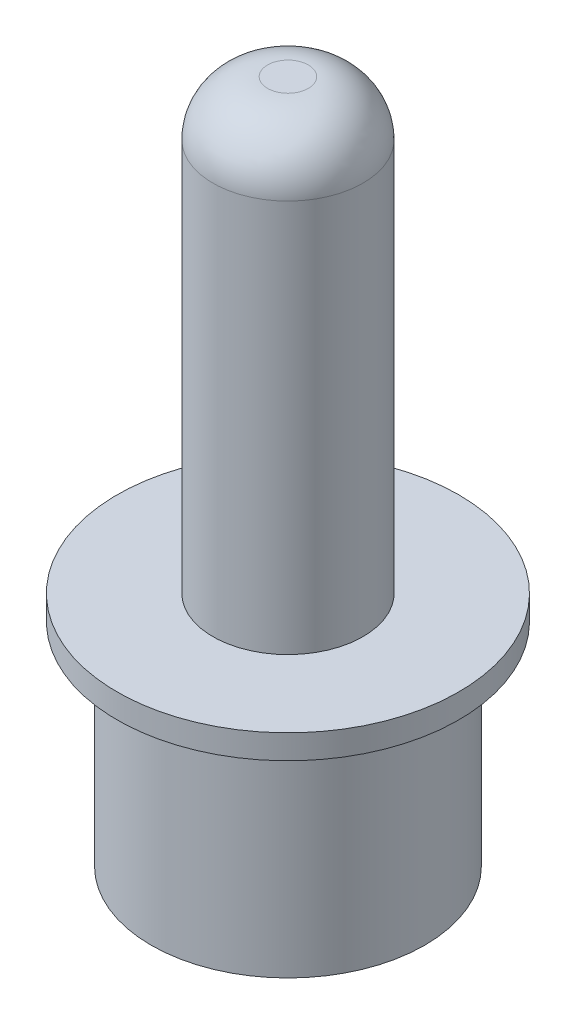
ISO-10303-21;
HEADER;
FILE_DESCRIPTION(('STEP AP214'),'2;1');
FILE_NAME('part.step','',(''),(''),'','','');
FILE_SCHEMA(('AUTOMOTIVE_DESIGN { 1 0 10303 214 1 1 1 1 }'));
ENDSEC;
DATA;
#1=APPLICATION_CONTEXT('core data for automotive mechanical design processes');
#2=APPLICATION_PROTOCOL_DEFINITION('international standard','automotive_design',2000,#1);
#3=PRODUCT_CONTEXT('',#1,'mechanical');
#4=PRODUCT('Part','Part','',(#3));
#5=PRODUCT_RELATED_PRODUCT_CATEGORY('part','',(#4));
#6=PRODUCT_DEFINITION_FORMATION('','',#4);
#7=PRODUCT_DEFINITION_CONTEXT('part definition',#1,'design');
#8=PRODUCT_DEFINITION('design','',#6,#7);
#9=PRODUCT_DEFINITION_SHAPE('','',#8);
#10=(LENGTH_UNIT() NAMED_UNIT(*) SI_UNIT(.MILLI.,.METRE.));
#11=(NAMED_UNIT(*) PLANE_ANGLE_UNIT() SI_UNIT($,.RADIAN.));
#12=(NAMED_UNIT(*) SI_UNIT($,.STERADIAN.) SOLID_ANGLE_UNIT());
#13=UNCERTAINTY_MEASURE_WITH_UNIT(LENGTH_MEASURE(1.E-05),#10,'distance_accuracy_value','');
#14=(GEOMETRIC_REPRESENTATION_CONTEXT(3) GLOBAL_UNCERTAINTY_ASSIGNED_CONTEXT((#13)) GLOBAL_UNIT_ASSIGNED_CONTEXT((#10,
#11,#12)) REPRESENTATION_CONTEXT('',''));
#15=CARTESIAN_POINT('',(0.,0.,0.));
#16=DIRECTION('',(0.,0.,1.));
#17=DIRECTION('',(1.,0.,0.));
#18=AXIS2_PLACEMENT_3D('',#15,#16,#17);
#19=CARTESIAN_POINT('',(0.,0.,0.));
#20=DIRECTION('',(0.,1.,0.));
#21=DIRECTION('',(0.,0.,1.));
#22=AXIS2_PLACEMENT_3D('',#19,#20,#21);
#23=PLANE('',#22);
#24=CARTESIAN_POINT('',(0.,0.,0.));
#25=DIRECTION('',(0.,-1.,0.));
#26=DIRECTION('',(0.,0.,-1.));
#27=AXIS2_PLACEMENT_3D('',#24,#25,#26);
#28=CIRCLE('',#27,1.5);
#29=CARTESIAN_POINT('',(0.,0.,-1.5));
#30=VERTEX_POINT('',#29);
#31=EDGE_CURVE('E63',#30,#30,#28,.T.);
#32=ORIENTED_EDGE('',*,*,#31,.F.);
#33=EDGE_LOOP('',(#32));
#34=FACE_BOUND('',#33,.T.);
#35=CARTESIAN_POINT('',(0.,0.,0.));
#36=DIRECTION('',(0.,-1.,0.));
#37=DIRECTION('',(0.,0.,-1.));
#38=AXIS2_PLACEMENT_3D('',#35,#36,#37);
#39=CIRCLE('',#38,5.);
#40=CARTESIAN_POINT('',(0.,0.,-5.));
#41=VERTEX_POINT('',#40);
#42=EDGE_CURVE('E44',#41,#41,#39,.T.);
#43=ORIENTED_EDGE('',*,*,#42,.T.);
#44=EDGE_LOOP('',(#43));
#45=FACE_BOUND('',#44,.T.);
#46=ADVANCED_FACE('F33',(#34,#45),#23,.F.);
#47=CARTESIAN_POINT('',(0.,0.,0.));
#48=DIRECTION('',(0.,-1.,0.));
#49=DIRECTION('',(0.,0.,-1.));
#50=AXIS2_PLACEMENT_3D('',#47,#48,#49);
#51=CYLINDRICAL_SURFACE('',#50,5.);
#52=ORIENTED_EDGE('',*,*,#42,.F.);
#53=EDGE_LOOP('',(#52));
#54=FACE_BOUND('',#53,.T.);
#55=CARTESIAN_POINT('',(0.,7.34311741162873,0.));
#56=DIRECTION('',(0.,-1.,0.));
#57=DIRECTION('',(0.,0.,-1.));
#58=AXIS2_PLACEMENT_3D('',#55,#56,#57);
#59=CIRCLE('',#58,5.);
#60=CARTESIAN_POINT('',(0.,7.34311741162873,-5.));
#61=VERTEX_POINT('',#60);
#62=EDGE_CURVE('E48',#61,#61,#59,.T.);
#63=ORIENTED_EDGE('',*,*,#62,.T.);
#64=EDGE_LOOP('',(#63));
#65=FACE_BOUND('',#64,.T.);
#66=ADVANCED_FACE('F79',(#54,#65),#51,.T.);
#67=CARTESIAN_POINT('',(0.,7.75587059294787,0.));
#68=DIRECTION('',(0.,1.,0.));
#69=DIRECTION('',(0.,0.,1.));
#70=AXIS2_PLACEMENT_3D('',#67,#68,#69);
#71=CONICAL_SURFACE('',#70,6.24411285293071,1.25045787747329);
#72=ORIENTED_EDGE('',*,*,#62,.F.);
#73=EDGE_LOOP('',(#72));
#74=FACE_BOUND('',#73,.T.);
#75=CARTESIAN_POINT('',(0.,7.75587059294787,0.));
#76=DIRECTION('',(0.,-1.,0.));
#77=DIRECTION('',(0.,0.,-1.));
#78=AXIS2_PLACEMENT_3D('',#75,#76,#77);
#79=CIRCLE('',#78,6.24411285293071);
#80=CARTESIAN_POINT('',(0.,7.75587059294787,-6.24411285293071));
#81=VERTEX_POINT('',#80);
#82=EDGE_CURVE('E53',#81,#81,#79,.T.);
#83=ORIENTED_EDGE('',*,*,#82,.T.);
#84=EDGE_LOOP('',(#83));
#85=FACE_BOUND('',#84,.T.);
#86=ADVANCED_FACE('F84',(#74,#85),#71,.T.);
#87=CARTESIAN_POINT('',(0.,0.,0.));
#88=DIRECTION('',(0.,-1.,0.));
#89=DIRECTION('',(0.,0.,-1.));
#90=AXIS2_PLACEMENT_3D('',#87,#88,#89);
#91=CYLINDRICAL_SURFACE('',#90,6.24411285293071);
#92=ORIENTED_EDGE('',*,*,#82,.F.);
#93=EDGE_LOOP('',(#92));
#94=FACE_BOUND('',#93,.T.);
#95=CARTESIAN_POINT('',(0.,8.64209144852606,0.));
#96=DIRECTION('',(0.,-1.,0.));
#97=DIRECTION('',(0.,0.,-1.));
#98=AXIS2_PLACEMENT_3D('',#95,#96,#97);
#99=CIRCLE('',#98,6.24411285293071);
#100=CARTESIAN_POINT('',(0.,8.64209144852606,-6.24411285293071));
#101=VERTEX_POINT('',#100);
#102=EDGE_CURVE('E56',#101,#101,#99,.T.);
#103=ORIENTED_EDGE('',*,*,#102,.T.);
#104=EDGE_LOOP('',(#103));
#105=FACE_BOUND('',#104,.T.);
#106=ADVANCED_FACE('F90',(#94,#105),#91,.T.);
#107=CARTESIAN_POINT('',(-6.24411285293071,8.64209144852606,0.));
#108=DIRECTION('',(0.,-1.,0.));
#109=DIRECTION('',(0.,0.,-1.));
#110=AXIS2_PLACEMENT_3D('',#107,#108,#109);
#111=PLANE('',#110);
#112=ORIENTED_EDGE('',*,*,#102,.F.);
#113=EDGE_LOOP('',(#112));
#114=FACE_BOUND('',#113,.T.);
#115=CARTESIAN_POINT('',(0.,8.64209144852606,0.));
#116=DIRECTION('',(0.,-1.,0.));
#117=DIRECTION('',(0.,0.,-1.));
#118=AXIS2_PLACEMENT_3D('',#115,#116,#117);
#119=CIRCLE('',#118,2.74411285293071);
#120=CARTESIAN_POINT('',(0.,8.64209144852606,-2.74411285293071));
#121=VERTEX_POINT('',#120);
#122=EDGE_CURVE('E59',#121,#121,#119,.T.);
#123=ORIENTED_EDGE('',*,*,#122,.T.);
#124=EDGE_LOOP('',(#123));
#125=FACE_BOUND('',#124,.T.);
#126=ADVANCED_FACE('F96',(#114,#125),#111,.F.);
#127=CARTESIAN_POINT('',(0.,0.,0.));
#128=DIRECTION('',(0.,-1.,0.));
#129=DIRECTION('',(0.,0.,-1.));
#130=AXIS2_PLACEMENT_3D('',#127,#128,#129);
#131=CYLINDRICAL_SURFACE('',#130,2.74411285293071);
#132=CARTESIAN_POINT('',(0.,23.,0.));
#133=DIRECTION('',(0.,-1.,0.));
#134=DIRECTION('',(0.,0.,-1.));
#135=AXIS2_PLACEMENT_3D('',#132,#133,#134);
#136=CIRCLE('',#135,2.74411285293071);
#137=CARTESIAN_POINT('',(0.,23.,-2.74411285293071));
#138=VERTEX_POINT('',#137);
#139=EDGE_CURVE('E40',#138,#138,#136,.T.);
#140=ORIENTED_EDGE('',*,*,#139,.T.);
#141=EDGE_LOOP('',(#140));
#142=FACE_BOUND('',#141,.T.);
#143=ORIENTED_EDGE('',*,*,#122,.F.);
#144=EDGE_LOOP('',(#143));
#145=FACE_BOUND('',#144,.T.);
#146=ADVANCED_FACE('F102',(#142,#145),#131,.T.);
#147=CARTESIAN_POINT('',(-2.74411285293071,25.,0.));
#148=DIRECTION('',(0.,-1.,0.));
#149=DIRECTION('',(0.,0.,-1.));
#150=AXIS2_PLACEMENT_3D('',#147,#148,#149);
#151=PLANE('',#150);
#152=CARTESIAN_POINT('',(0.,25.,0.));
#153=DIRECTION('',(0.,-1.,0.));
#154=DIRECTION('',(0.,0.,-1.));
#155=AXIS2_PLACEMENT_3D('',#152,#153,#154);
#156=CIRCLE('',#155,0.744112852930712);
#157=CARTESIAN_POINT('',(0.,25.,-0.744112852930712));
#158=VERTEX_POINT('',#157);
#159=EDGE_CURVE('E10',#158,#158,#156,.F.);
#160=ORIENTED_EDGE('',*,*,#159,.T.);
#161=EDGE_LOOP('',(#160));
#162=FACE_BOUND('',#161,.T.);
#163=ADVANCED_FACE('F107',(#162),#151,.F.);
#164=CARTESIAN_POINT('',(0.,23.,0.));
#165=DIRECTION('',(0.,-1.,0.));
#166=DIRECTION('',(0.,0.,-1.));
#167=AXIS2_PLACEMENT_3D('',#164,#165,#166);
#168=DEGENERATE_TOROIDAL_SURFACE('',#167,0.744112852930712,2.,.T.);
#169=ORIENTED_EDGE('',*,*,#159,.F.);
#170=EDGE_LOOP('',(#169));
#171=FACE_BOUND('',#170,.T.);
#172=ORIENTED_EDGE('',*,*,#139,.F.);
#173=EDGE_LOOP('',(#172));
#174=FACE_BOUND('',#173,.T.);
#175=ADVANCED_FACE('F35',(#171,#174),#168,.T.);
#176=CARTESIAN_POINT('',(0.,18.,0.));
#177=DIRECTION('',(0.,-1.,0.));
#178=DIRECTION('',(0.,0.,-1.));
#179=AXIS2_PLACEMENT_3D('',#176,#177,#178);
#180=CYLINDRICAL_SURFACE('',#179,1.5);
#181=CARTESIAN_POINT('',(0.,18.,0.));
#182=DIRECTION('',(0.,-1.,0.));
#183=DIRECTION('',(0.,0.,-1.));
#184=AXIS2_PLACEMENT_3D('',#181,#182,#183);
#185=CIRCLE('',#184,1.5);
#186=CARTESIAN_POINT('',(0.,18.,-1.5));
#187=VERTEX_POINT('',#186);
#188=EDGE_CURVE('E62',#187,#187,#185,.T.);
#189=ORIENTED_EDGE('',*,*,#188,.F.);
#190=EDGE_LOOP('',(#189));
#191=FACE_BOUND('',#190,.T.);
#192=ORIENTED_EDGE('',*,*,#31,.T.);
#193=EDGE_LOOP('',(#192));
#194=FACE_BOUND('',#193,.T.);
#195=ADVANCED_FACE('F71',(#191,#194),#180,.F.);
#196=CARTESIAN_POINT('',(0.,18.,0.));
#197=DIRECTION('',(0.,-1.,0.));
#198=DIRECTION('',(0.,0.,-1.));
#199=AXIS2_PLACEMENT_3D('',#196,#197,#198);
#200=PLANE('',#199);
#201=ORIENTED_EDGE('',*,*,#188,.T.);
#202=EDGE_LOOP('',(#201));
#203=FACE_BOUND('',#202,.T.);
#204=ADVANCED_FACE('F69',(#203),#200,.T.);
#205=CLOSED_SHELL('',(#46,#66,#86,#106,#126,#146,#163,#175,#195,#204));
#206=MANIFOLD_SOLID_BREP('B2',#205);
#207=ADVANCED_BREP_SHAPE_REPRESENTATION('',(#18,#206),#14);
#208=SHAPE_DEFINITION_REPRESENTATION(#9,#207);
ENDSEC;
END-ISO-10303-21;
